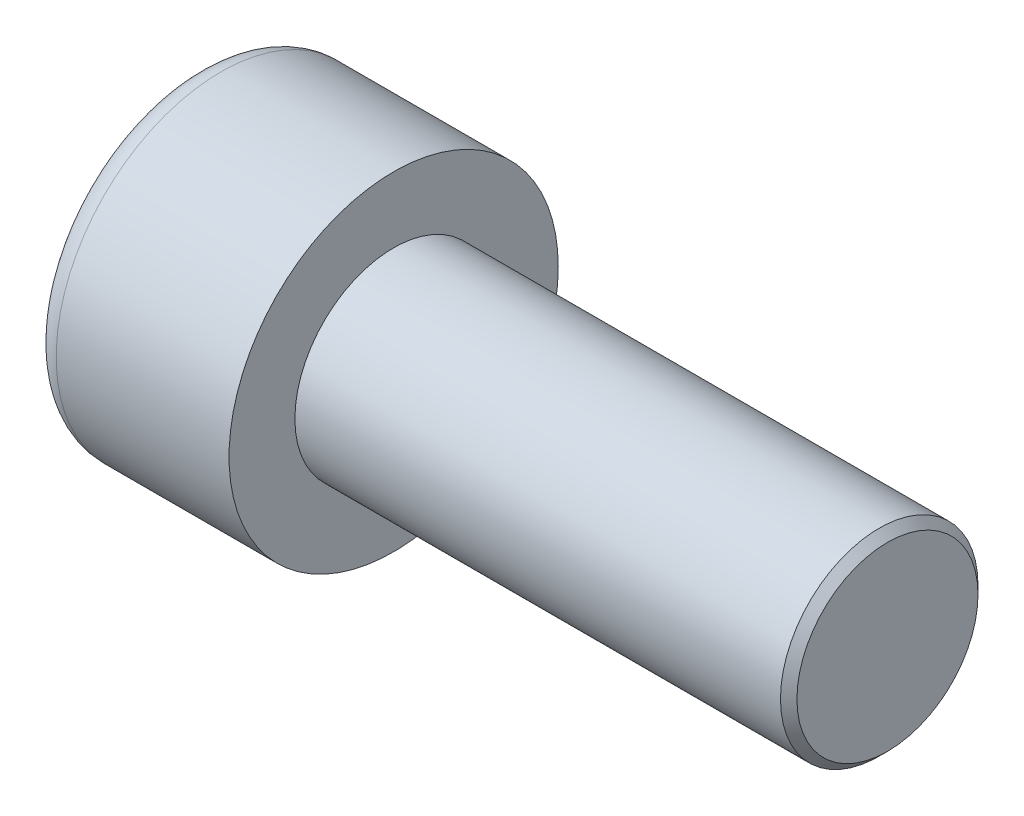
ISO-10303-21;
HEADER;
FILE_DESCRIPTION(('STEP AP214'),'2;1');
FILE_NAME('part.step','',(''),(''),'','','');
FILE_SCHEMA(('AUTOMOTIVE_DESIGN { 1 0 10303 214 1 1 1 1 }'));
ENDSEC;
DATA;
#1=APPLICATION_CONTEXT('core data for automotive mechanical design processes');
#2=APPLICATION_PROTOCOL_DEFINITION('international standard','automotive_design',2000,#1);
#3=PRODUCT_CONTEXT('',#1,'mechanical');
#4=PRODUCT('Part','Part','',(#3));
#5=PRODUCT_RELATED_PRODUCT_CATEGORY('part','',(#4));
#6=PRODUCT_DEFINITION_FORMATION('','',#4);
#7=PRODUCT_DEFINITION_CONTEXT('part definition',#1,'design');
#8=PRODUCT_DEFINITION('design','',#6,#7);
#9=PRODUCT_DEFINITION_SHAPE('','',#8);
#10=(LENGTH_UNIT() NAMED_UNIT(*) SI_UNIT(.MILLI.,.METRE.));
#11=(NAMED_UNIT(*) PLANE_ANGLE_UNIT() SI_UNIT($,.RADIAN.));
#12=(NAMED_UNIT(*) SI_UNIT($,.STERADIAN.) SOLID_ANGLE_UNIT());
#13=UNCERTAINTY_MEASURE_WITH_UNIT(LENGTH_MEASURE(1.E-05),#10,'distance_accuracy_value','');
#14=(GEOMETRIC_REPRESENTATION_CONTEXT(3) GLOBAL_UNCERTAINTY_ASSIGNED_CONTEXT((#13)) GLOBAL_UNIT_ASSIGNED_CONTEXT((#10,
#11,#12)) REPRESENTATION_CONTEXT('',''));
#15=CARTESIAN_POINT('',(0.,0.,0.));
#16=DIRECTION('',(0.,0.,1.));
#17=DIRECTION('',(1.,0.,0.));
#18=AXIS2_PLACEMENT_3D('',#15,#16,#17);
#19=CARTESIAN_POINT('',(3.,0.,-2.88675134594813));
#20=DIRECTION('',(1.,0.,0.));
#21=DIRECTION('',(0.,0.,-1.));
#22=AXIS2_PLACEMENT_3D('',#19,#20,#21);
#23=PLANE('',#22);
#24=CARTESIAN_POINT('',(3.,0.,0.));
#25=DIRECTION('',(1.,0.,0.));
#26=DIRECTION('',(0.,0.,-1.));
#27=AXIS2_PLACEMENT_3D('',#24,#25,#26);
#28=CIRCLE('',#27,2.5);
#29=CARTESIAN_POINT('',(3.,-1.25,-2.1650635094611));
#30=VERTEX_POINT('',#29);
#31=CARTESIAN_POINT('',(3.,-2.5,0.));
#32=VERTEX_POINT('',#31);
#33=EDGE_CURVE('E165',#30,#32,#28,.F.);
#34=ORIENTED_EDGE('',*,*,#33,.F.);
#35=DIRECTION('',(0.,0.866025403784439,-0.5));
#36=VECTOR('',#35,1.);
#37=CARTESIAN_POINT('',(3.,-2.5,-1.44337567297407));
#38=LINE('',#37,#36);
#39=CARTESIAN_POINT('',(3.,-2.5,-1.44337567297407));
#40=VERTEX_POINT('',#39);
#41=EDGE_CURVE('E173',#40,#30,#38,.T.);
#42=ORIENTED_EDGE('',*,*,#41,.F.);
#43=DIRECTION('',(0.,0.,-1.));
#44=VECTOR('',#43,1.);
#45=CARTESIAN_POINT('',(3.,-2.5,1.44337567297406));
#46=LINE('',#45,#44);
#47=EDGE_CURVE('E190',#32,#40,#46,.T.);
#48=ORIENTED_EDGE('',*,*,#47,.F.);
#49=EDGE_LOOP('',(#34,#42,#48));
#50=FACE_BOUND('',#49,.T.);
#51=ADVANCED_FACE('F42',(#50),#23,.F.);
#52=CARTESIAN_POINT('',(3.,-1.25,2.1650635094611));
#53=VERTEX_POINT('',#52);
#54=EDGE_CURVE('E295',#32,#53,#28,.F.);
#55=ORIENTED_EDGE('',*,*,#54,.F.);
#56=CARTESIAN_POINT('',(3.,-2.5,1.44337567297406));
#57=VERTEX_POINT('',#56);
#58=EDGE_CURVE('E191',#57,#32,#46,.T.);
#59=ORIENTED_EDGE('',*,*,#58,.F.);
#60=DIRECTION('',(0.,-0.866025403784438,-0.5));
#61=VECTOR('',#60,1.);
#62=CARTESIAN_POINT('',(3.,0.,2.88675134594813));
#63=LINE('',#62,#61);
#64=EDGE_CURVE('E186',#53,#57,#63,.T.);
#65=ORIENTED_EDGE('',*,*,#64,.F.);
#66=EDGE_LOOP('',(#55,#59,#65));
#67=FACE_BOUND('',#66,.T.);
#68=ADVANCED_FACE('F131',(#67),#23,.F.);
#69=CARTESIAN_POINT('',(3.,1.25,2.1650635094611));
#70=VERTEX_POINT('',#69);
#71=EDGE_CURVE('E291',#53,#70,#28,.F.);
#72=ORIENTED_EDGE('',*,*,#71,.F.);
#73=CARTESIAN_POINT('',(3.,0.,2.88675134594813));
#74=VERTEX_POINT('',#73);
#75=EDGE_CURVE('E187',#74,#53,#63,.T.);
#76=ORIENTED_EDGE('',*,*,#75,.F.);
#77=DIRECTION('',(0.,-0.866025403784439,0.5));
#78=VECTOR('',#77,1.);
#79=CARTESIAN_POINT('',(3.,2.5,1.44337567297406));
#80=LINE('',#79,#78);
#81=EDGE_CURVE('E182',#70,#74,#80,.T.);
#82=ORIENTED_EDGE('',*,*,#81,.F.);
#83=EDGE_LOOP('',(#72,#76,#82));
#84=FACE_BOUND('',#83,.T.);
#85=ADVANCED_FACE('F137',(#84),#23,.F.);
#86=CARTESIAN_POINT('',(3.,2.5,0.));
#87=VERTEX_POINT('',#86);
#88=EDGE_CURVE('E162',#70,#87,#28,.F.);
#89=ORIENTED_EDGE('',*,*,#88,.F.);
#90=CARTESIAN_POINT('',(3.,2.5,1.44337567297406));
#91=VERTEX_POINT('',#90);
#92=EDGE_CURVE('E183',#91,#70,#80,.T.);
#93=ORIENTED_EDGE('',*,*,#92,.F.);
#94=DIRECTION('',(0.,0.,1.));
#95=VECTOR('',#94,1.);
#96=CARTESIAN_POINT('',(3.,2.5,-1.44337567297406));
#97=LINE('',#96,#95);
#98=EDGE_CURVE('E177',#87,#91,#97,.T.);
#99=ORIENTED_EDGE('',*,*,#98,.F.);
#100=EDGE_LOOP('',(#89,#93,#99));
#101=FACE_BOUND('',#100,.T.);
#102=ADVANCED_FACE('F151',(#101),#23,.F.);
#103=CARTESIAN_POINT('',(3.,0.,0.));
#104=DIRECTION('',(1.,0.,0.));
#105=DIRECTION('',(0.,0.,-1.));
#106=AXIS2_PLACEMENT_3D('',#103,#104,#105);
#107=CIRCLE('',#106,2.5);
#108=CARTESIAN_POINT('',(3.,1.25,-2.1650635094611));
#109=VERTEX_POINT('',#108);
#110=EDGE_CURVE('E57',#109,#87,#107,.T.);
#111=ORIENTED_EDGE('',*,*,#110,.T.);
#112=CARTESIAN_POINT('',(3.,2.5,-1.44337567297406));
#113=VERTEX_POINT('',#112);
#114=EDGE_CURVE('E170',#113,#87,#97,.T.);
#115=ORIENTED_EDGE('',*,*,#114,.F.);
#116=DIRECTION('',(0.,0.866025403784438,0.5));
#117=VECTOR('',#116,1.);
#118=CARTESIAN_POINT('',(3.,0.,-2.88675134594813));
#119=LINE('',#118,#117);
#120=EDGE_CURVE('E167',#109,#113,#119,.T.);
#121=ORIENTED_EDGE('',*,*,#120,.F.);
#122=EDGE_LOOP('',(#111,#115,#121));
#123=FACE_BOUND('',#122,.T.);
#124=ADVANCED_FACE('F142',(#123),#23,.F.);
#125=EDGE_CURVE('E155',#109,#30,#28,.F.);
#126=ORIENTED_EDGE('',*,*,#125,.F.);
#127=CARTESIAN_POINT('',(3.,0.,-2.88675134594813));
#128=VERTEX_POINT('',#127);
#129=EDGE_CURVE('E158',#128,#109,#119,.T.);
#130=ORIENTED_EDGE('',*,*,#129,.F.);
#131=EDGE_CURVE('E160',#30,#128,#38,.T.);
#132=ORIENTED_EDGE('',*,*,#131,.F.);
#133=EDGE_LOOP('',(#126,#130,#132));
#134=FACE_BOUND('',#133,.T.);
#135=ADVANCED_FACE('F133',(#134),#23,.F.);
#136=CARTESIAN_POINT('',(0.,0.,0.));
#137=DIRECTION('',(1.,0.,0.));
#138=DIRECTION('',(0.,0.,-1.));
#139=AXIS2_PLACEMENT_3D('',#136,#137,#138);
#140=PLANE('',#139);
#141=CARTESIAN_POINT('',(0.,0.,0.));
#142=DIRECTION('',(1.,0.,0.));
#143=DIRECTION('',(0.,0.,-1.));
#144=AXIS2_PLACEMENT_3D('',#141,#142,#143);
#145=CIRCLE('',#144,4.25);
#146=CARTESIAN_POINT('',(0.,0.,-4.25));
#147=VERTEX_POINT('',#146);
#148=EDGE_CURVE('E230',#147,#147,#145,.F.);
#149=ORIENTED_EDGE('',*,*,#148,.T.);
#150=EDGE_LOOP('',(#149));
#151=FACE_BOUND('',#150,.T.);
#152=DIRECTION('',(0.,0.866025403784439,-0.5));
#153=VECTOR('',#152,1.);
#154=CARTESIAN_POINT('',(0.,-2.5,-1.44337567297407));
#155=LINE('',#154,#153);
#156=CARTESIAN_POINT('',(0.,-2.5,-1.44337567297407));
#157=VERTEX_POINT('',#156);
#158=CARTESIAN_POINT('',(0.,0.,-2.88675134594813));
#159=VERTEX_POINT('',#158);
#160=EDGE_CURVE('E65',#157,#159,#155,.T.);
#161=ORIENTED_EDGE('',*,*,#160,.T.);
#162=DIRECTION('',(0.,0.866025403784438,0.5));
#163=VECTOR('',#162,1.);
#164=CARTESIAN_POINT('',(0.,0.,-2.88675134594813));
#165=LINE('',#164,#163);
#166=CARTESIAN_POINT('',(0.,2.5,-1.44337567297406));
#167=VERTEX_POINT('',#166);
#168=EDGE_CURVE('E196',#159,#167,#165,.T.);
#169=ORIENTED_EDGE('',*,*,#168,.T.);
#170=DIRECTION('',(0.,0.,1.));
#171=VECTOR('',#170,1.);
#172=CARTESIAN_POINT('',(0.,2.5,-1.44337567297406));
#173=LINE('',#172,#171);
#174=CARTESIAN_POINT('',(0.,2.5,1.44337567297406));
#175=VERTEX_POINT('',#174);
#176=EDGE_CURVE('E199',#167,#175,#173,.T.);
#177=ORIENTED_EDGE('',*,*,#176,.T.);
#178=DIRECTION('',(0.,-0.866025403784439,0.5));
#179=VECTOR('',#178,1.);
#180=CARTESIAN_POINT('',(0.,2.5,1.44337567297406));
#181=LINE('',#180,#179);
#182=CARTESIAN_POINT('',(0.,0.,2.88675134594813));
#183=VERTEX_POINT('',#182);
#184=EDGE_CURVE('E202',#175,#183,#181,.T.);
#185=ORIENTED_EDGE('',*,*,#184,.T.);
#186=DIRECTION('',(0.,-0.866025403784438,-0.5));
#187=VECTOR('',#186,1.);
#188=CARTESIAN_POINT('',(0.,0.,2.88675134594813));
#189=LINE('',#188,#187);
#190=CARTESIAN_POINT('',(0.,-2.5,1.44337567297406));
#191=VERTEX_POINT('',#190);
#192=EDGE_CURVE('E205',#183,#191,#189,.T.);
#193=ORIENTED_EDGE('',*,*,#192,.T.);
#194=DIRECTION('',(0.,0.,-1.));
#195=VECTOR('',#194,1.);
#196=CARTESIAN_POINT('',(0.,-2.5,1.44337567297406));
#197=LINE('',#196,#195);
#198=EDGE_CURVE('E208',#191,#157,#197,.T.);
#199=ORIENTED_EDGE('',*,*,#198,.T.);
#200=EDGE_LOOP('',(#161,#169,#177,#185,#193,#199));
#201=FACE_BOUND('',#200,.T.);
#202=ADVANCED_FACE('F141',(#151,#201),#140,.F.);
#203=CARTESIAN_POINT('',(6.,0.,0.));
#204=DIRECTION('',(1.,0.,0.));
#205=DIRECTION('',(0.,0.,-1.));
#206=AXIS2_PLACEMENT_3D('',#203,#204,#205);
#207=PLANE('',#206);
#208=CARTESIAN_POINT('',(6.,0.,0.));
#209=DIRECTION('',(1.,0.,0.));
#210=DIRECTION('',(0.,0.,-1.));
#211=AXIS2_PLACEMENT_3D('',#208,#209,#210);
#212=CIRCLE('',#211,5.);
#213=CARTESIAN_POINT('',(6.,0.,-5.));
#214=VERTEX_POINT('',#213);
#215=EDGE_CURVE('E163',#214,#214,#212,.T.);
#216=ORIENTED_EDGE('',*,*,#215,.T.);
#217=EDGE_LOOP('',(#216));
#218=FACE_BOUND('',#217,.T.);
#219=CARTESIAN_POINT('',(6.,0.,0.));
#220=DIRECTION('',(1.,0.,0.));
#221=DIRECTION('',(0.,0.,-1.));
#222=AXIS2_PLACEMENT_3D('',#219,#220,#221);
#223=CIRCLE('',#222,3.);
#224=CARTESIAN_POINT('',(6.,0.,-3.));
#225=VERTEX_POINT('',#224);
#226=EDGE_CURVE('E221',#225,#225,#223,.T.);
#227=ORIENTED_EDGE('',*,*,#226,.F.);
#228=EDGE_LOOP('',(#227));
#229=FACE_BOUND('',#228,.T.);
#230=ADVANCED_FACE('F148',(#218,#229),#207,.T.);
#231=CARTESIAN_POINT('',(6.,0.,0.));
#232=DIRECTION('',(-1.,0.,0.));
#233=DIRECTION('',(0.,0.,1.));
#234=AXIS2_PLACEMENT_3D('',#231,#232,#233);
#235=CYLINDRICAL_SURFACE('',#234,5.);
#236=CARTESIAN_POINT('',(0.75,0.,0.));
#237=DIRECTION('',(1.,0.,0.));
#238=DIRECTION('',(0.,0.,-1.));
#239=AXIS2_PLACEMENT_3D('',#236,#237,#238);
#240=CIRCLE('',#239,5.);
#241=CARTESIAN_POINT('',(0.75,0.,-5.));
#242=VERTEX_POINT('',#241);
#243=EDGE_CURVE('E227',#242,#242,#240,.T.);
#244=ORIENTED_EDGE('',*,*,#243,.T.);
#245=EDGE_LOOP('',(#244));
#246=FACE_BOUND('',#245,.T.);
#247=ORIENTED_EDGE('',*,*,#215,.F.);
#248=EDGE_LOOP('',(#247));
#249=FACE_BOUND('',#248,.T.);
#250=ADVANCED_FACE('F246',(#246,#249),#235,.T.);
#251=CARTESIAN_POINT('',(21.,0.,0.));
#252=DIRECTION('',(-1.,0.,0.));
#253=DIRECTION('',(0.,0.,1.));
#254=AXIS2_PLACEMENT_3D('',#251,#252,#253);
#255=CYLINDRICAL_SURFACE('',#254,3.);
#256=CARTESIAN_POINT('',(20.75,0.,0.));
#257=DIRECTION('',(1.,0.,0.));
#258=DIRECTION('',(0.,0.,-1.));
#259=AXIS2_PLACEMENT_3D('',#256,#257,#258);
#260=CIRCLE('',#259,3.);
#261=CARTESIAN_POINT('',(20.75,0.,-3.));
#262=VERTEX_POINT('',#261);
#263=EDGE_CURVE('E11',#262,#262,#260,.F.);
#264=ORIENTED_EDGE('',*,*,#263,.T.);
#265=EDGE_LOOP('',(#264));
#266=FACE_BOUND('',#265,.T.);
#267=ORIENTED_EDGE('',*,*,#226,.T.);
#268=EDGE_LOOP('',(#267));
#269=FACE_BOUND('',#268,.T.);
#270=ADVANCED_FACE('F243',(#266,#269),#255,.T.);
#271=CARTESIAN_POINT('',(21.,0.,0.));
#272=DIRECTION('',(1.,0.,0.));
#273=DIRECTION('',(0.,0.,-1.));
#274=AXIS2_PLACEMENT_3D('',#271,#272,#273);
#275=PLANE('',#274);
#276=CARTESIAN_POINT('',(21.,0.,0.));
#277=DIRECTION('',(1.,0.,0.));
#278=DIRECTION('',(0.,0.,-1.));
#279=AXIS2_PLACEMENT_3D('',#276,#277,#278);
#280=CIRCLE('',#279,2.75);
#281=CARTESIAN_POINT('',(21.,0.,-2.75));
#282=VERTEX_POINT('',#281);
#283=EDGE_CURVE('E50',#282,#282,#280,.T.);
#284=ORIENTED_EDGE('',*,*,#283,.T.);
#285=EDGE_LOOP('',(#284));
#286=FACE_BOUND('',#285,.T.);
#287=ADVANCED_FACE('F235',(#286),#275,.T.);
#288=CARTESIAN_POINT('',(3.,-2.5,-1.44337567297407));
#289=DIRECTION('',(0.,0.5,0.866025403784439));
#290=DIRECTION('',(0.,-0.866025403784439,0.5));
#291=AXIS2_PLACEMENT_3D('',#288,#289,#290);
#292=PLANE('',#291);
#293=ORIENTED_EDGE('',*,*,#160,.F.);
#294=DIRECTION('',(-1.,0.,0.));
#295=VECTOR('',#294,1.);
#296=CARTESIAN_POINT('',(3.,-2.5,-1.44337567297407));
#297=LINE('',#296,#295);
#298=EDGE_CURVE('E194',#40,#157,#297,.T.);
#299=ORIENTED_EDGE('',*,*,#298,.F.);
#300=ORIENTED_EDGE('',*,*,#41,.T.);
#301=ORIENTED_EDGE('',*,*,#131,.T.);
#302=DIRECTION('',(-1.,0.,0.));
#303=VECTOR('',#302,1.);
#304=CARTESIAN_POINT('',(3.,0.,-2.88675134594813));
#305=LINE('',#304,#303);
#306=EDGE_CURVE('E176',#128,#159,#305,.T.);
#307=ORIENTED_EDGE('',*,*,#306,.T.);
#308=EDGE_LOOP('',(#293,#299,#300,#301,#307));
#309=FACE_BOUND('',#308,.T.);
#310=ADVANCED_FACE('F261',(#309),#292,.T.);
#311=CARTESIAN_POINT('',(3.,0.,-2.88675134594813));
#312=DIRECTION('',(0.,-0.5,0.866025403784438));
#313=DIRECTION('',(0.,-0.866025403784439,-0.5));
#314=AXIS2_PLACEMENT_3D('',#311,#312,#313);
#315=PLANE('',#314);
#316=ORIENTED_EDGE('',*,*,#168,.F.);
#317=ORIENTED_EDGE('',*,*,#306,.F.);
#318=ORIENTED_EDGE('',*,*,#129,.T.);
#319=ORIENTED_EDGE('',*,*,#120,.T.);
#320=DIRECTION('',(-1.,0.,0.));
#321=VECTOR('',#320,1.);
#322=CARTESIAN_POINT('',(3.,2.5,-1.44337567297406));
#323=LINE('',#322,#321);
#324=EDGE_CURVE('E218',#113,#167,#323,.T.);
#325=ORIENTED_EDGE('',*,*,#324,.T.);
#326=EDGE_LOOP('',(#316,#317,#318,#319,#325));
#327=FACE_BOUND('',#326,.T.);
#328=ADVANCED_FACE('F175',(#327),#315,.T.);
#329=CARTESIAN_POINT('',(3.,2.5,-1.44337567297406));
#330=DIRECTION('',(0.,-1.,0.));
#331=DIRECTION('',(0.,0.,-1.));
#332=AXIS2_PLACEMENT_3D('',#329,#330,#331);
#333=PLANE('',#332);
#334=ORIENTED_EDGE('',*,*,#176,.F.);
#335=ORIENTED_EDGE('',*,*,#324,.F.);
#336=ORIENTED_EDGE('',*,*,#114,.T.);
#337=ORIENTED_EDGE('',*,*,#98,.T.);
#338=DIRECTION('',(-1.,0.,0.));
#339=VECTOR('',#338,1.);
#340=CARTESIAN_POINT('',(3.,2.5,1.44337567297406));
#341=LINE('',#340,#339);
#342=EDGE_CURVE('E216',#91,#175,#341,.T.);
#343=ORIENTED_EDGE('',*,*,#342,.T.);
#344=EDGE_LOOP('',(#334,#335,#336,#337,#343));
#345=FACE_BOUND('',#344,.T.);
#346=ADVANCED_FACE('F266',(#345),#333,.T.);
#347=CARTESIAN_POINT('',(3.,2.5,1.44337567297406));
#348=DIRECTION('',(0.,-0.5,-0.866025403784439));
#349=DIRECTION('',(0.,0.866025403784439,-0.5));
#350=AXIS2_PLACEMENT_3D('',#347,#348,#349);
#351=PLANE('',#350);
#352=ORIENTED_EDGE('',*,*,#184,.F.);
#353=ORIENTED_EDGE('',*,*,#342,.F.);
#354=ORIENTED_EDGE('',*,*,#92,.T.);
#355=ORIENTED_EDGE('',*,*,#81,.T.);
#356=DIRECTION('',(-1.,0.,0.));
#357=VECTOR('',#356,1.);
#358=CARTESIAN_POINT('',(3.,0.,2.88675134594813));
#359=LINE('',#358,#357);
#360=EDGE_CURVE('E214',#74,#183,#359,.T.);
#361=ORIENTED_EDGE('',*,*,#360,.T.);
#362=EDGE_LOOP('',(#352,#353,#354,#355,#361));
#363=FACE_BOUND('',#362,.T.);
#364=ADVANCED_FACE('F269',(#363),#351,.T.);
#365=CARTESIAN_POINT('',(3.,0.,2.88675134594813));
#366=DIRECTION('',(0.,0.5,-0.866025403784439));
#367=DIRECTION('',(0.,0.866025403784439,0.5));
#368=AXIS2_PLACEMENT_3D('',#365,#366,#367);
#369=PLANE('',#368);
#370=ORIENTED_EDGE('',*,*,#192,.F.);
#371=ORIENTED_EDGE('',*,*,#360,.F.);
#372=ORIENTED_EDGE('',*,*,#75,.T.);
#373=ORIENTED_EDGE('',*,*,#64,.T.);
#374=DIRECTION('',(-1.,0.,0.));
#375=VECTOR('',#374,1.);
#376=CARTESIAN_POINT('',(3.,-2.5,1.44337567297406));
#377=LINE('',#376,#375);
#378=EDGE_CURVE('E212',#57,#191,#377,.T.);
#379=ORIENTED_EDGE('',*,*,#378,.T.);
#380=EDGE_LOOP('',(#370,#371,#372,#373,#379));
#381=FACE_BOUND('',#380,.T.);
#382=ADVANCED_FACE('F126',(#381),#369,.T.);
#383=CARTESIAN_POINT('',(3.,-2.5,1.44337567297406));
#384=DIRECTION('',(0.,1.,0.));
#385=DIRECTION('',(0.,0.,1.));
#386=AXIS2_PLACEMENT_3D('',#383,#384,#385);
#387=PLANE('',#386);
#388=ORIENTED_EDGE('',*,*,#198,.F.);
#389=ORIENTED_EDGE('',*,*,#378,.F.);
#390=ORIENTED_EDGE('',*,*,#58,.T.);
#391=ORIENTED_EDGE('',*,*,#47,.T.);
#392=ORIENTED_EDGE('',*,*,#298,.T.);
#393=EDGE_LOOP('',(#388,#389,#390,#391,#392));
#394=FACE_BOUND('',#393,.T.);
#395=ADVANCED_FACE('F119',(#394),#387,.T.);
#396=CARTESIAN_POINT('',(3.,0.,0.));
#397=DIRECTION('',(-1.,0.,0.));
#398=DIRECTION('',(0.,0.,1.));
#399=AXIS2_PLACEMENT_3D('',#396,#397,#398);
#400=CONICAL_SURFACE('',#399,2.5,1.04719755119659);
#401=CARTESIAN_POINT('',(4.44337567297408,0.,0.));
#402=VERTEX_POINT('',#401);
#403=VERTEX_LOOP('',#402);
#404=FACE_BOUND('',#403,.T.);
#405=ORIENTED_EDGE('',*,*,#110,.F.);
#406=ORIENTED_EDGE('',*,*,#125,.T.);
#407=ORIENTED_EDGE('',*,*,#33,.T.);
#408=ORIENTED_EDGE('',*,*,#54,.T.);
#409=ORIENTED_EDGE('',*,*,#71,.T.);
#410=ORIENTED_EDGE('',*,*,#88,.T.);
#411=EDGE_LOOP('',(#405,#406,#407,#408,#409,#410));
#412=FACE_BOUND('',#411,.T.);
#413=ADVANCED_FACE('F116',(#404,#412),#400,.F.);
#414=CARTESIAN_POINT('',(0.75,0.,0.));
#415=DIRECTION('',(1.,0.,0.));
#416=DIRECTION('',(0.,0.,-1.));
#417=AXIS2_PLACEMENT_3D('',#414,#415,#416);
#418=TOROIDAL_SURFACE('',#417,4.25,0.75);
#419=ORIENTED_EDGE('',*,*,#148,.F.);
#420=EDGE_LOOP('',(#419));
#421=FACE_BOUND('',#420,.T.);
#422=ORIENTED_EDGE('',*,*,#243,.F.);
#423=EDGE_LOOP('',(#422));
#424=FACE_BOUND('',#423,.T.);
#425=ADVANCED_FACE('F118',(#421,#424),#418,.T.);
#426=CARTESIAN_POINT('',(21.,0.,0.));
#427=DIRECTION('',(-1.,0.,0.));
#428=DIRECTION('',(0.,0.,1.));
#429=AXIS2_PLACEMENT_3D('',#426,#427,#428);
#430=CONICAL_SURFACE('',#429,2.75,0.785398163397444);
#431=ORIENTED_EDGE('',*,*,#263,.F.);
#432=EDGE_LOOP('',(#431));
#433=FACE_BOUND('',#432,.T.);
#434=ORIENTED_EDGE('',*,*,#283,.F.);
#435=EDGE_LOOP('',(#434));
#436=FACE_BOUND('',#435,.T.);
#437=ADVANCED_FACE('F44',(#433,#436),#430,.T.);
#438=CLOSED_SHELL('',(#51,#68,#85,#102,#124,#135,#202,#230,#250,#270,#287,#310,#328,#346,#364,
#382,#395,#413,#425,#437));
#439=MANIFOLD_SOLID_BREP('B2',#438);
#440=ADVANCED_BREP_SHAPE_REPRESENTATION('',(#18,#439),#14);
#441=SHAPE_DEFINITION_REPRESENTATION(#9,#440);
ENDSEC;
END-ISO-10303-21;
